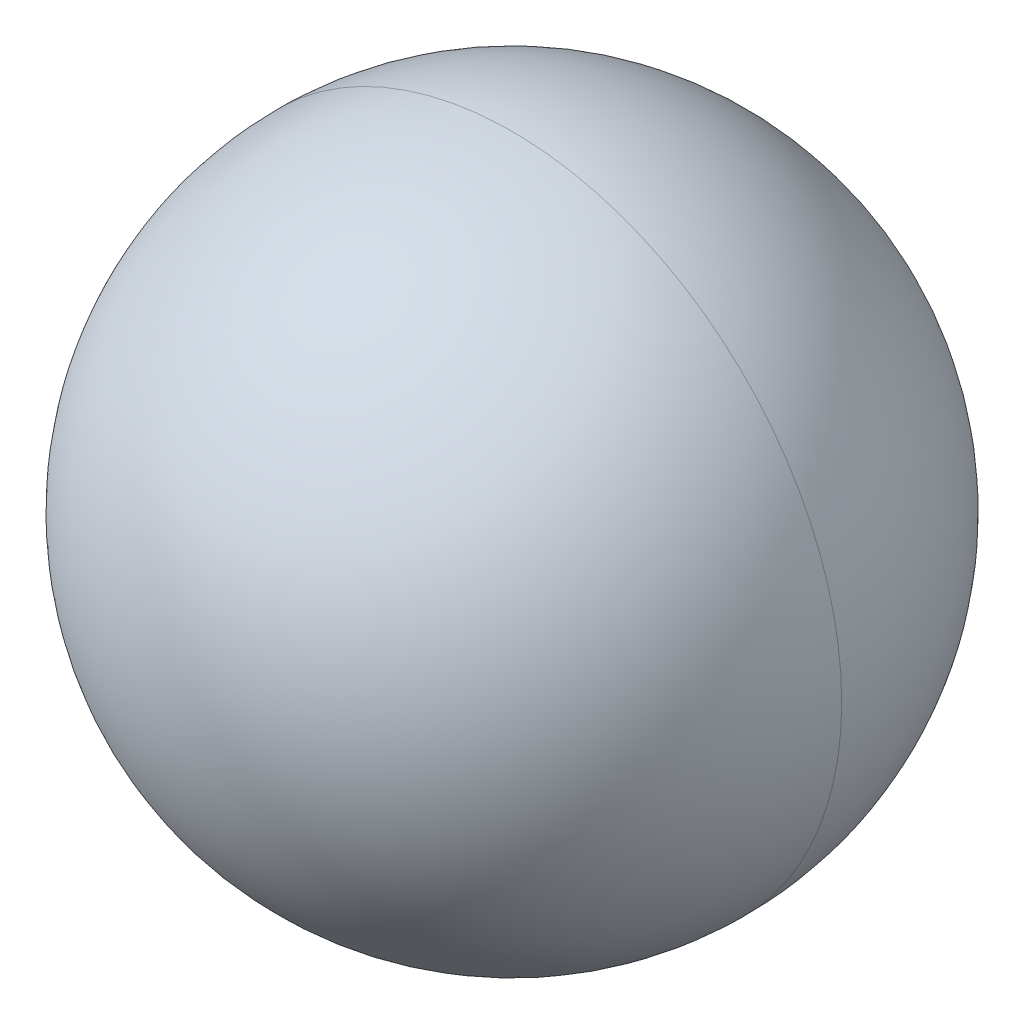
ISO-10303-21;
HEADER;
FILE_DESCRIPTION(('STEP AP214'),'2;1');
FILE_NAME('part.step','',(''),(''),'','','');
FILE_SCHEMA(('AUTOMOTIVE_DESIGN { 1 0 10303 214 1 1 1 1 }'));
ENDSEC;
DATA;
#1=APPLICATION_CONTEXT('core data for automotive mechanical design processes');
#2=APPLICATION_PROTOCOL_DEFINITION('international standard','automotive_design',2000,#1);
#3=PRODUCT_CONTEXT('',#1,'mechanical');
#4=PRODUCT('Part','Part','',(#3));
#5=PRODUCT_RELATED_PRODUCT_CATEGORY('part','',(#4));
#6=PRODUCT_DEFINITION_FORMATION('','',#4);
#7=PRODUCT_DEFINITION_CONTEXT('part definition',#1,'design');
#8=PRODUCT_DEFINITION('design','',#6,#7);
#9=PRODUCT_DEFINITION_SHAPE('','',#8);
#10=(LENGTH_UNIT() NAMED_UNIT(*) SI_UNIT(.MILLI.,.METRE.));
#11=(NAMED_UNIT(*) PLANE_ANGLE_UNIT() SI_UNIT($,.RADIAN.));
#12=(NAMED_UNIT(*) SI_UNIT($,.STERADIAN.) SOLID_ANGLE_UNIT());
#13=UNCERTAINTY_MEASURE_WITH_UNIT(LENGTH_MEASURE(1.E-05),#10,'distance_accuracy_value','');
#14=(GEOMETRIC_REPRESENTATION_CONTEXT(3) GLOBAL_UNCERTAINTY_ASSIGNED_CONTEXT((#13)) GLOBAL_UNIT_ASSIGNED_CONTEXT((#10,
#11,#12)) REPRESENTATION_CONTEXT('',''));
#15=CARTESIAN_POINT('',(0.,0.,0.));
#16=DIRECTION('',(0.,0.,1.));
#17=DIRECTION('',(1.,0.,0.));
#18=AXIS2_PLACEMENT_3D('',#15,#16,#17);
#19=CARTESIAN_POINT('',(0.,0.,0.));
#20=DIRECTION('',(1.,0.,0.));
#21=DIRECTION('',(0.,0.,-1.));
#22=AXIS2_PLACEMENT_3D('',#19,#20,#21);
#23=SPHERICAL_SURFACE('',#22,2.5);
#24=CARTESIAN_POINT('',(0.,0.,0.));
#25=DIRECTION('',(0.,0.,1.));
#26=DIRECTION('',(1.,0.,0.));
#27=AXIS2_PLACEMENT_3D('',#24,#25,#26);
#28=CIRCLE('',#27,2.5);
#29=CARTESIAN_POINT('',(2.5,0.,0.));
#30=VERTEX_POINT('',#29);
#31=CARTESIAN_POINT('',(-2.5,0.,0.));
#32=VERTEX_POINT('',#31);
#33=EDGE_CURVE('E11',#30,#32,#28,.T.);
#34=ORIENTED_EDGE('',*,*,#33,.T.);
#35=CARTESIAN_POINT('',(0.,0.,0.));
#36=DIRECTION('',(0.,0.,-1.));
#37=DIRECTION('',(1.,0.,0.));
#38=AXIS2_PLACEMENT_3D('',#35,#36,#37);
#39=CIRCLE('',#38,2.5);
#40=EDGE_CURVE('E25',#30,#32,#39,.T.);
#41=ORIENTED_EDGE('',*,*,#40,.F.);
#42=EDGE_LOOP('',(#34,#41));
#43=FACE_BOUND('',#42,.T.);
#44=ADVANCED_FACE('F17',(#43),#23,.T.);
#45=CARTESIAN_POINT('',(0.,0.,0.));
#46=DIRECTION('',(1.,0.,0.));
#47=DIRECTION('',(0.,0.,1.));
#48=AXIS2_PLACEMENT_3D('',#45,#46,#47);
#49=SPHERICAL_SURFACE('',#48,2.5);
#50=ORIENTED_EDGE('',*,*,#33,.F.);
#51=ORIENTED_EDGE('',*,*,#40,.T.);
#52=EDGE_LOOP('',(#50,#51));
#53=FACE_BOUND('',#52,.T.);
#54=ADVANCED_FACE('F33',(#53),#49,.T.);
#55=CLOSED_SHELL('',(#44,#54));
#56=MANIFOLD_SOLID_BREP('B1',#55);
#57=ADVANCED_BREP_SHAPE_REPRESENTATION('',(#18,#56),#14);
#58=SHAPE_DEFINITION_REPRESENTATION(#9,#57);
ENDSEC;
END-ISO-10303-21;
